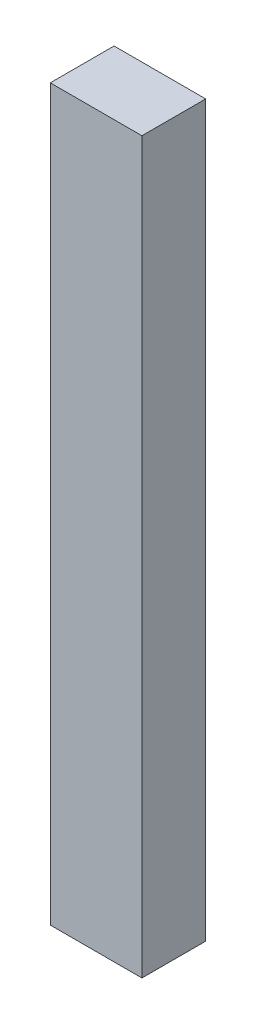
ISO-10303-21;
HEADER;
FILE_DESCRIPTION(('STEP AP214'),'2;1');
FILE_NAME('part.step','',(''),(''),'','','');
FILE_SCHEMA(('AUTOMOTIVE_DESIGN { 1 0 10303 214 1 1 1 1 }'));
ENDSEC;
DATA;
#1=APPLICATION_CONTEXT('core data for automotive mechanical design processes');
#2=APPLICATION_PROTOCOL_DEFINITION('international standard','automotive_design',2000,#1);
#3=PRODUCT_CONTEXT('',#1,'mechanical');
#4=PRODUCT('Part','Part','',(#3));
#5=PRODUCT_RELATED_PRODUCT_CATEGORY('part','',(#4));
#6=PRODUCT_DEFINITION_FORMATION('','',#4);
#7=PRODUCT_DEFINITION_CONTEXT('part definition',#1,'design');
#8=PRODUCT_DEFINITION('design','',#6,#7);
#9=PRODUCT_DEFINITION_SHAPE('','',#8);
#10=(LENGTH_UNIT() NAMED_UNIT(*) SI_UNIT(.MILLI.,.METRE.));
#11=(NAMED_UNIT(*) PLANE_ANGLE_UNIT() SI_UNIT($,.RADIAN.));
#12=(NAMED_UNIT(*) SI_UNIT($,.STERADIAN.) SOLID_ANGLE_UNIT());
#13=UNCERTAINTY_MEASURE_WITH_UNIT(LENGTH_MEASURE(1.E-05),#10,'distance_accuracy_value','');
#14=(GEOMETRIC_REPRESENTATION_CONTEXT(3) GLOBAL_UNCERTAINTY_ASSIGNED_CONTEXT((#13)) GLOBAL_UNIT_ASSIGNED_CONTEXT((#10,
#11,#12)) REPRESENTATION_CONTEXT('',''));
#15=CARTESIAN_POINT('',(0.,0.,0.));
#16=DIRECTION('',(0.,0.,1.));
#17=DIRECTION('',(1.,0.,0.));
#18=AXIS2_PLACEMENT_3D('',#15,#16,#17);
#19=CARTESIAN_POINT('',(0.62500002,-4.97499894,0.8700008));
#20=DIRECTION('',(0.,0.,-1.));
#21=DIRECTION('',(0.,-1.,0.));
#22=AXIS2_PLACEMENT_3D('',#19,#20,#21);
#23=PLANE('',#22);
#24=DIRECTION('',(0.,1.,0.));
#25=VECTOR('',#24,1.);
#26=CARTESIAN_POINT('',(0.62500002,-4.97499894,0.8700008));
#27=LINE('',#26,#25);
#28=CARTESIAN_POINT('',(0.62500002,-4.97499894,0.8700008));
#29=VERTEX_POINT('',#28);
#30=CARTESIAN_POINT('',(0.62500002,4.97499894,0.8700008));
#31=VERTEX_POINT('',#30);
#32=EDGE_CURVE('E91',#29,#31,#27,.T.);
#33=ORIENTED_EDGE('',*,*,#32,.T.);
#34=DIRECTION('',(-1.,0.,0.));
#35=VECTOR('',#34,1.);
#36=CARTESIAN_POINT('',(0.62500002,4.97499894,0.8700008));
#37=LINE('',#36,#35);
#38=CARTESIAN_POINT('',(-0.62500002,4.97499894,0.8700008));
#39=VERTEX_POINT('',#38);
#40=EDGE_CURVE('E56',#31,#39,#37,.T.);
#41=ORIENTED_EDGE('',*,*,#40,.T.);
#42=DIRECTION('',(0.,-1.,0.));
#43=VECTOR('',#42,1.);
#44=CARTESIAN_POINT('',(-0.62500002,4.97499894,0.8700008));
#45=LINE('',#44,#43);
#46=CARTESIAN_POINT('',(-0.62500002,-4.97499894,0.8700008));
#47=VERTEX_POINT('',#46);
#48=EDGE_CURVE('E83',#39,#47,#45,.T.);
#49=ORIENTED_EDGE('',*,*,#48,.T.);
#50=DIRECTION('',(1.,0.,0.));
#51=VECTOR('',#50,1.);
#52=CARTESIAN_POINT('',(-0.62500002,-4.97499894,0.8700008));
#53=LINE('',#52,#51);
#54=EDGE_CURVE('E10',#47,#29,#53,.T.);
#55=ORIENTED_EDGE('',*,*,#54,.T.);
#56=EDGE_LOOP('',(#33,#41,#49,#55));
#57=FACE_BOUND('',#56,.T.);
#58=ADVANCED_FACE('F16',(#57),#23,.F.);
#59=CARTESIAN_POINT('',(0.62500002,-4.97499894,0.));
#60=DIRECTION('',(0.,0.,-1.));
#61=DIRECTION('',(0.,-1.,0.));
#62=AXIS2_PLACEMENT_3D('',#59,#60,#61);
#63=PLANE('',#62);
#64=DIRECTION('',(1.,0.,0.));
#65=VECTOR('',#64,1.);
#66=CARTESIAN_POINT('',(-0.62500002,-4.97499894,0.));
#67=LINE('',#66,#65);
#68=CARTESIAN_POINT('',(-0.62500002,-4.97499894,0.));
#69=VERTEX_POINT('',#68);
#70=CARTESIAN_POINT('',(0.62500002,-4.97499894,0.));
#71=VERTEX_POINT('',#70);
#72=EDGE_CURVE('E27',#69,#71,#67,.T.);
#73=ORIENTED_EDGE('',*,*,#72,.F.);
#74=DIRECTION('',(0.,-1.,0.));
#75=VECTOR('',#74,1.);
#76=CARTESIAN_POINT('',(-0.62500002,4.97499894,0.));
#77=LINE('',#76,#75);
#78=CARTESIAN_POINT('',(-0.62500002,4.97499894,0.));
#79=VERTEX_POINT('',#78);
#80=EDGE_CURVE('E77',#79,#69,#77,.T.);
#81=ORIENTED_EDGE('',*,*,#80,.F.);
#82=DIRECTION('',(-1.,0.,0.));
#83=VECTOR('',#82,1.);
#84=CARTESIAN_POINT('',(0.62500002,4.97499894,0.));
#85=LINE('',#84,#83);
#86=CARTESIAN_POINT('',(0.62500002,4.97499894,0.));
#87=VERTEX_POINT('',#86);
#88=EDGE_CURVE('E20',#87,#79,#85,.T.);
#89=ORIENTED_EDGE('',*,*,#88,.F.);
#90=DIRECTION('',(0.,1.,0.));
#91=VECTOR('',#90,1.);
#92=CARTESIAN_POINT('',(0.62500002,-4.97499894,0.));
#93=LINE('',#92,#91);
#94=EDGE_CURVE('E114',#71,#87,#93,.T.);
#95=ORIENTED_EDGE('',*,*,#94,.F.);
#96=EDGE_LOOP('',(#73,#81,#89,#95));
#97=FACE_BOUND('',#96,.T.);
#98=ADVANCED_FACE('F18',(#97),#63,.T.);
#99=CARTESIAN_POINT('',(-0.62500002,-4.97499894,0.));
#100=DIRECTION('',(0.,1.,0.));
#101=DIRECTION('',(1.,0.,0.));
#102=AXIS2_PLACEMENT_3D('',#99,#100,#101);
#103=PLANE('',#102);
#104=ORIENTED_EDGE('',*,*,#72,.T.);
#105=DIRECTION('',(0.,0.,1.));
#106=VECTOR('',#105,1.);
#107=CARTESIAN_POINT('',(0.62500002,-4.97499894,0.));
#108=LINE('',#107,#106);
#109=EDGE_CURVE('E102',#71,#29,#108,.T.);
#110=ORIENTED_EDGE('',*,*,#109,.T.);
#111=ORIENTED_EDGE('',*,*,#54,.F.);
#112=DIRECTION('',(0.,0.,1.));
#113=VECTOR('',#112,1.);
#114=CARTESIAN_POINT('',(-0.62500002,-4.97499894,0.));
#115=LINE('',#114,#113);
#116=EDGE_CURVE('E86',#69,#47,#115,.T.);
#117=ORIENTED_EDGE('',*,*,#116,.F.);
#118=EDGE_LOOP('',(#104,#110,#111,#117));
#119=FACE_BOUND('',#118,.T.);
#120=ADVANCED_FACE('F162',(#119),#103,.F.);
#121=CARTESIAN_POINT('',(-0.62500002,4.97499894,0.));
#122=DIRECTION('',(1.,0.,0.));
#123=DIRECTION('',(0.,1.,0.));
#124=AXIS2_PLACEMENT_3D('',#121,#122,#123);
#125=PLANE('',#124);
#126=ORIENTED_EDGE('',*,*,#80,.T.);
#127=ORIENTED_EDGE('',*,*,#116,.T.);
#128=ORIENTED_EDGE('',*,*,#48,.F.);
#129=DIRECTION('',(0.,0.,1.));
#130=VECTOR('',#129,1.);
#131=CARTESIAN_POINT('',(-0.62500002,4.97499894,0.));
#132=LINE('',#131,#130);
#133=EDGE_CURVE('E85',#79,#39,#132,.T.);
#134=ORIENTED_EDGE('',*,*,#133,.F.);
#135=EDGE_LOOP('',(#126,#127,#128,#134));
#136=FACE_BOUND('',#135,.T.);
#137=ADVANCED_FACE('F84',(#136),#125,.F.);
#138=CARTESIAN_POINT('',(0.62500002,4.97499894,0.));
#139=DIRECTION('',(0.,-1.,0.));
#140=DIRECTION('',(0.,0.,-1.));
#141=AXIS2_PLACEMENT_3D('',#138,#139,#140);
#142=PLANE('',#141);
#143=ORIENTED_EDGE('',*,*,#88,.T.);
#144=ORIENTED_EDGE('',*,*,#133,.T.);
#145=ORIENTED_EDGE('',*,*,#40,.F.);
#146=DIRECTION('',(0.,0.,1.));
#147=VECTOR('',#146,1.);
#148=CARTESIAN_POINT('',(0.62500002,4.97499894,0.));
#149=LINE('',#148,#147);
#150=EDGE_CURVE('E112',#87,#31,#149,.T.);
#151=ORIENTED_EDGE('',*,*,#150,.F.);
#152=EDGE_LOOP('',(#143,#144,#145,#151));
#153=FACE_BOUND('',#152,.T.);
#154=ADVANCED_FACE('F95',(#153),#142,.F.);
#155=CARTESIAN_POINT('',(0.62500002,-4.97499894,0.));
#156=DIRECTION('',(-1.,0.,0.));
#157=DIRECTION('',(0.,0.,1.));
#158=AXIS2_PLACEMENT_3D('',#155,#156,#157);
#159=PLANE('',#158);
#160=ORIENTED_EDGE('',*,*,#94,.T.);
#161=ORIENTED_EDGE('',*,*,#150,.T.);
#162=ORIENTED_EDGE('',*,*,#32,.F.);
#163=ORIENTED_EDGE('',*,*,#109,.F.);
#164=EDGE_LOOP('',(#160,#161,#162,#163));
#165=FACE_BOUND('',#164,.T.);
#166=ADVANCED_FACE('F179',(#165),#159,.F.);
#167=CLOSED_SHELL('',(#58,#98,#120,#137,#154,#166));
#168=MANIFOLD_SOLID_BREP('B1',#167);
#169=ADVANCED_BREP_SHAPE_REPRESENTATION('',(#18,#168),#14);
#170=SHAPE_DEFINITION_REPRESENTATION(#9,#169);
ENDSEC;
END-ISO-10303-21;
